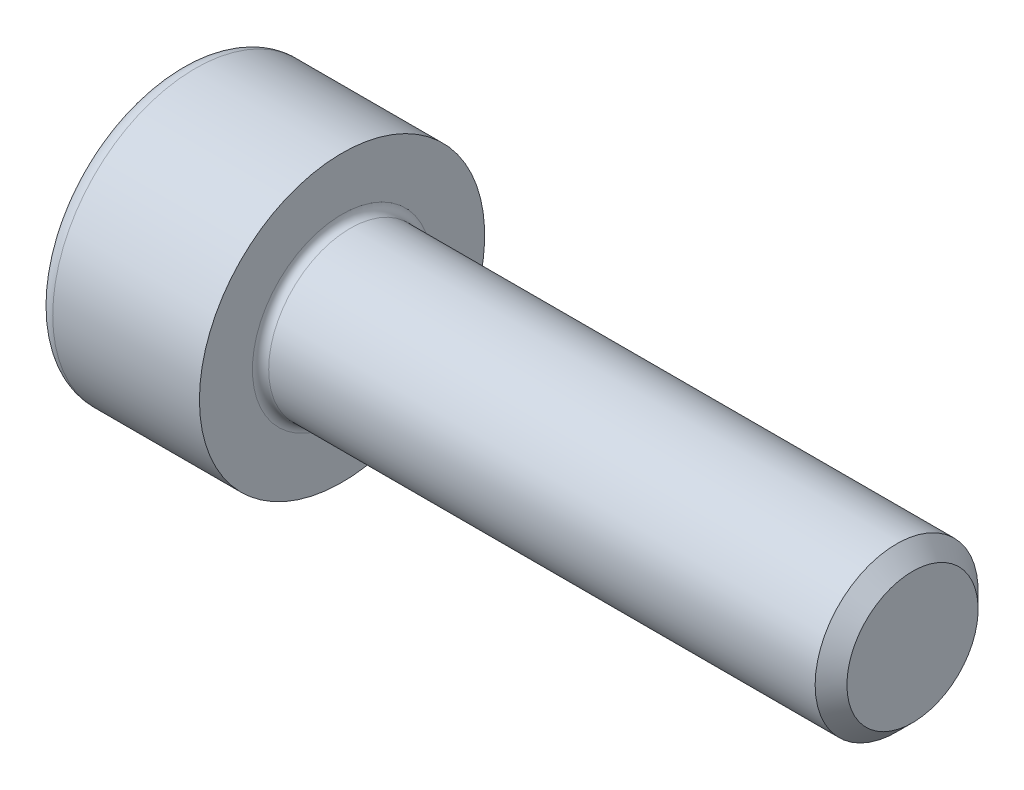
ISO-10303-21;
HEADER;
FILE_DESCRIPTION(('STEP AP214'),'2;1');
FILE_NAME('part.step','',(''),(''),'','','');
FILE_SCHEMA(('AUTOMOTIVE_DESIGN { 1 0 10303 214 1 1 1 1 }'));
ENDSEC;
DATA;
#1=APPLICATION_CONTEXT('core data for automotive mechanical design processes');
#2=APPLICATION_PROTOCOL_DEFINITION('international standard','automotive_design',2000,#1);
#3=PRODUCT_CONTEXT('',#1,'mechanical');
#4=PRODUCT('Part','Part','',(#3));
#5=PRODUCT_RELATED_PRODUCT_CATEGORY('part','',(#4));
#6=PRODUCT_DEFINITION_FORMATION('','',#4);
#7=PRODUCT_DEFINITION_CONTEXT('part definition',#1,'design');
#8=PRODUCT_DEFINITION('design','',#6,#7);
#9=PRODUCT_DEFINITION_SHAPE('','',#8);
#10=(LENGTH_UNIT() NAMED_UNIT(*) SI_UNIT(.MILLI.,.METRE.));
#11=(NAMED_UNIT(*) PLANE_ANGLE_UNIT() SI_UNIT($,.RADIAN.));
#12=(NAMED_UNIT(*) SI_UNIT($,.STERADIAN.) SOLID_ANGLE_UNIT());
#13=UNCERTAINTY_MEASURE_WITH_UNIT(LENGTH_MEASURE(1.E-05),#10,'distance_accuracy_value','');
#14=(GEOMETRIC_REPRESENTATION_CONTEXT(3) GLOBAL_UNCERTAINTY_ASSIGNED_CONTEXT((#13)) GLOBAL_UNIT_ASSIGNED_CONTEXT((#10,
#11,#12)) REPRESENTATION_CONTEXT('',''));
#15=CARTESIAN_POINT('',(0.,0.,0.));
#16=DIRECTION('',(0.,0.,1.));
#17=DIRECTION('',(1.,0.,0.));
#18=AXIS2_PLACEMENT_3D('',#15,#16,#17);
#19=CARTESIAN_POINT('',(0.,0.,0.));
#20=DIRECTION('',(-1.,0.,0.));
#21=DIRECTION('',(0.,0.,1.));
#22=AXIS2_PLACEMENT_3D('',#19,#20,#21);
#23=PLANE('',#22);
#24=DIRECTION('',(0.,-0.5,0.866025403784439));
#25=VECTOR('',#24,1.);
#26=CARTESIAN_POINT('',(0.,1.74359781295267,0.));
#27=LINE('',#26,#25);
#28=CARTESIAN_POINT('',(0.,1.74359781295267,0.));
#29=VERTEX_POINT('',#28);
#30=CARTESIAN_POINT('',(0.,0.87179890647633,1.51));
#31=VERTEX_POINT('',#30);
#32=EDGE_CURVE('E270',#29,#31,#27,.T.);
#33=ORIENTED_EDGE('',*,*,#32,.T.);
#34=DIRECTION('',(0.,1.,0.));
#35=VECTOR('',#34,1.);
#36=CARTESIAN_POINT('',(0.,-0.87179890647634,1.51));
#37=LINE('',#36,#35);
#38=CARTESIAN_POINT('',(0.,-0.87179890647634,1.51));
#39=VERTEX_POINT('',#38);
#40=EDGE_CURVE('E142',#39,#31,#37,.T.);
#41=ORIENTED_EDGE('',*,*,#40,.F.);
#42=DIRECTION('',(0.,-0.500000000000001,-0.866025403784438));
#43=VECTOR('',#42,1.);
#44=CARTESIAN_POINT('',(0.,-0.87179890647634,1.51));
#45=LINE('',#44,#43);
#46=CARTESIAN_POINT('',(0.,-1.74359781295268,0.));
#47=VERTEX_POINT('',#46);
#48=EDGE_CURVE('E273',#39,#47,#45,.T.);
#49=ORIENTED_EDGE('',*,*,#48,.T.);
#50=DIRECTION('',(0.,0.5,-0.866025403784439));
#51=VECTOR('',#50,1.);
#52=CARTESIAN_POINT('',(0.,-1.74359781295268,0.));
#53=LINE('',#52,#51);
#54=CARTESIAN_POINT('',(0.,-0.871798906476343,-1.51));
#55=VERTEX_POINT('',#54);
#56=EDGE_CURVE('E276',#47,#55,#53,.T.);
#57=ORIENTED_EDGE('',*,*,#56,.T.);
#58=DIRECTION('',(0.,-1.,0.));
#59=VECTOR('',#58,1.);
#60=CARTESIAN_POINT('',(0.,0.871798906476328,-1.51));
#61=LINE('',#60,#59);
#62=CARTESIAN_POINT('',(0.,0.871798906476328,-1.51));
#63=VERTEX_POINT('',#62);
#64=EDGE_CURVE('E279',#63,#55,#61,.T.);
#65=ORIENTED_EDGE('',*,*,#64,.F.);
#66=DIRECTION('',(0.,-0.500000000000001,-0.866025403784438));
#67=VECTOR('',#66,1.);
#68=CARTESIAN_POINT('',(0.,1.74359781295267,0.));
#69=LINE('',#68,#67);
#70=EDGE_CURVE('E137',#29,#63,#69,.T.);
#71=ORIENTED_EDGE('',*,*,#70,.F.);
#72=EDGE_LOOP('',(#33,#41,#49,#57,#65,#71));
#73=FACE_BOUND('',#72,.T.);
#74=CARTESIAN_POINT('',(0.,0.,0.));
#75=DIRECTION('',(-1.,0.,0.));
#76=DIRECTION('',(0.,0.,1.));
#77=AXIS2_PLACEMENT_3D('',#74,#75,#76);
#78=CIRCLE('',#77,3.1);
#79=CARTESIAN_POINT('',(0.,0.,3.1));
#80=VERTEX_POINT('',#79);
#81=EDGE_CURVE('E54',#80,#80,#78,.T.);
#82=ORIENTED_EDGE('',*,*,#81,.T.);
#83=EDGE_LOOP('',(#82));
#84=FACE_BOUND('',#83,.T.);
#85=ADVANCED_FACE('F46',(#73,#84),#23,.T.);
#86=CARTESIAN_POINT('',(-31.75,0.,0.));
#87=DIRECTION('',(-1.,0.,0.));
#88=DIRECTION('',(0.,0.,1.));
#89=AXIS2_PLACEMENT_3D('',#86,#87,#88);
#90=CYLINDRICAL_SURFACE('',#89,3.5);
#91=CARTESIAN_POINT('',(0.399999999999998,0.,0.));
#92=DIRECTION('',(-1.,0.,0.));
#93=DIRECTION('',(0.,0.,1.));
#94=AXIS2_PLACEMENT_3D('',#91,#92,#93);
#95=CIRCLE('',#94,3.5);
#96=CARTESIAN_POINT('',(0.399999999999998,0.,3.5));
#97=VERTEX_POINT('',#96);
#98=EDGE_CURVE('E13',#97,#97,#95,.F.);
#99=ORIENTED_EDGE('',*,*,#98,.T.);
#100=EDGE_LOOP('',(#99));
#101=FACE_BOUND('',#100,.T.);
#102=CARTESIAN_POINT('',(4.,0.,0.));
#103=DIRECTION('',(-1.,0.,0.));
#104=DIRECTION('',(0.,0.,1.));
#105=AXIS2_PLACEMENT_3D('',#102,#103,#104);
#106=CIRCLE('',#105,3.5);
#107=CARTESIAN_POINT('',(4.,0.,3.5));
#108=VERTEX_POINT('',#107);
#109=EDGE_CURVE('E160',#108,#108,#106,.T.);
#110=ORIENTED_EDGE('',*,*,#109,.T.);
#111=EDGE_LOOP('',(#110));
#112=FACE_BOUND('',#111,.T.);
#113=ADVANCED_FACE('F184',(#101,#112),#90,.T.);
#114=CARTESIAN_POINT('',(4.,3.5,0.));
#115=DIRECTION('',(1.,0.,0.));
#116=DIRECTION('',(0.,0.,-1.));
#117=AXIS2_PLACEMENT_3D('',#114,#115,#116);
#118=PLANE('',#117);
#119=CARTESIAN_POINT('',(4.,0.,0.));
#120=DIRECTION('',(1.,0.,0.));
#121=DIRECTION('',(0.,0.,-1.));
#122=AXIS2_PLACEMENT_3D('',#119,#120,#121);
#123=CIRCLE('',#122,2.2);
#124=CARTESIAN_POINT('',(4.,0.,-2.2));
#125=VERTEX_POINT('',#124);
#126=EDGE_CURVE('E163',#125,#125,#123,.F.);
#127=ORIENTED_EDGE('',*,*,#126,.T.);
#128=EDGE_LOOP('',(#127));
#129=FACE_BOUND('',#128,.T.);
#130=ORIENTED_EDGE('',*,*,#109,.F.);
#131=EDGE_LOOP('',(#130));
#132=FACE_BOUND('',#131,.T.);
#133=ADVANCED_FACE('F190',(#129,#132),#118,.T.);
#134=CARTESIAN_POINT('',(-31.75,0.,0.));
#135=DIRECTION('',(-1.,0.,0.));
#136=DIRECTION('',(0.,0.,1.));
#137=AXIS2_PLACEMENT_3D('',#134,#135,#136);
#138=CYLINDRICAL_SURFACE('',#137,2.);
#139=CARTESIAN_POINT('',(4.2,0.,0.));
#140=DIRECTION('',(1.,0.,0.));
#141=DIRECTION('',(0.,0.,-1.));
#142=AXIS2_PLACEMENT_3D('',#139,#140,#141);
#143=CIRCLE('',#142,2.);
#144=CARTESIAN_POINT('',(4.2,0.,-2.));
#145=VERTEX_POINT('',#144);
#146=EDGE_CURVE('E166',#145,#145,#143,.T.);
#147=ORIENTED_EDGE('',*,*,#146,.T.);
#148=EDGE_LOOP('',(#147));
#149=FACE_BOUND('',#148,.T.);
#150=CARTESIAN_POINT('',(17.61,0.,0.));
#151=DIRECTION('',(-1.,0.,0.));
#152=DIRECTION('',(0.,0.,1.));
#153=AXIS2_PLACEMENT_3D('',#150,#151,#152);
#154=CIRCLE('',#153,1.99999999999999);
#155=CARTESIAN_POINT('',(17.61,0.,1.99999999999999));
#156=VERTEX_POINT('',#155);
#157=EDGE_CURVE('E157',#156,#156,#154,.T.);
#158=ORIENTED_EDGE('',*,*,#157,.T.);
#159=EDGE_LOOP('',(#158));
#160=FACE_BOUND('',#159,.T.);
#161=ADVANCED_FACE('F196',(#149,#160),#138,.T.);
#162=CARTESIAN_POINT('',(18.,0.,0.));
#163=DIRECTION('',(-1.,0.,0.));
#164=DIRECTION('',(0.,0.,1.));
#165=AXIS2_PLACEMENT_3D('',#162,#163,#164);
#166=CONICAL_SURFACE('',#165,1.61,0.785398163397438);
#167=ORIENTED_EDGE('',*,*,#157,.F.);
#168=EDGE_LOOP('',(#167));
#169=FACE_BOUND('',#168,.T.);
#170=CARTESIAN_POINT('',(18.,0.,0.));
#171=DIRECTION('',(-1.,0.,0.));
#172=DIRECTION('',(0.,0.,1.));
#173=AXIS2_PLACEMENT_3D('',#170,#171,#172);
#174=CIRCLE('',#173,1.61);
#175=CARTESIAN_POINT('',(18.,0.,1.61));
#176=VERTEX_POINT('',#175);
#177=EDGE_CURVE('E153',#176,#176,#174,.T.);
#178=ORIENTED_EDGE('',*,*,#177,.T.);
#179=EDGE_LOOP('',(#178));
#180=FACE_BOUND('',#179,.T.);
#181=ADVANCED_FACE('F200',(#169,#180),#166,.T.);
#182=CARTESIAN_POINT('',(18.,1.61,0.));
#183=DIRECTION('',(1.,0.,0.));
#184=DIRECTION('',(0.,0.,-1.));
#185=AXIS2_PLACEMENT_3D('',#182,#183,#184);
#186=PLANE('',#185);
#187=ORIENTED_EDGE('',*,*,#177,.F.);
#188=EDGE_LOOP('',(#187));
#189=FACE_BOUND('',#188,.T.);
#190=ADVANCED_FACE('F180',(#189),#186,.T.);
#191=CARTESIAN_POINT('',(4.2,0.,0.));
#192=DIRECTION('',(1.,0.,0.));
#193=DIRECTION('',(0.,0.,-1.));
#194=AXIS2_PLACEMENT_3D('',#191,#192,#193);
#195=TOROIDAL_SURFACE('',#194,2.2,0.2);
#196=ORIENTED_EDGE('',*,*,#146,.F.);
#197=EDGE_LOOP('',(#196));
#198=FACE_BOUND('',#197,.T.);
#199=ORIENTED_EDGE('',*,*,#126,.F.);
#200=EDGE_LOOP('',(#199));
#201=FACE_BOUND('',#200,.T.);
#202=ADVANCED_FACE('F173',(#198,#201),#195,.F.);
#203=CARTESIAN_POINT('',(0.399999999999998,0.,0.));
#204=DIRECTION('',(-1.,0.,0.));
#205=DIRECTION('',(0.,0.,1.));
#206=AXIS2_PLACEMENT_3D('',#203,#204,#205);
#207=TOROIDAL_SURFACE('',#206,3.1,0.4);
#208=ORIENTED_EDGE('',*,*,#98,.F.);
#209=EDGE_LOOP('',(#208));
#210=FACE_BOUND('',#209,.T.);
#211=ORIENTED_EDGE('',*,*,#81,.F.);
#212=EDGE_LOOP('',(#211));
#213=FACE_BOUND('',#212,.T.);
#214=ADVANCED_FACE('F48',(#210,#213),#207,.T.);
#215=CARTESIAN_POINT('',(2.,1.74359781295267,0.));
#216=DIRECTION('',(0.,-0.866025403784439,-0.5));
#217=DIRECTION('',(0.,0.5,-0.866025403784439));
#218=AXIS2_PLACEMENT_3D('',#215,#216,#217);
#219=PLANE('',#218);
#220=ORIENTED_EDGE('',*,*,#32,.F.);
#221=DIRECTION('',(-1.,0.,0.));
#222=VECTOR('',#221,1.);
#223=CARTESIAN_POINT('',(2.,1.74359781295267,0.));
#224=LINE('',#223,#222);
#225=CARTESIAN_POINT('',(2.,1.74359781295267,0.));
#226=VERTEX_POINT('',#225);
#227=EDGE_CURVE('E260',#226,#29,#224,.T.);
#228=ORIENTED_EDGE('',*,*,#227,.F.);
#229=DIRECTION('',(0.,-0.5,0.866025403784439));
#230=VECTOR('',#229,1.);
#231=CARTESIAN_POINT('',(2.,1.74359781295267,0.));
#232=LINE('',#231,#230);
#233=CARTESIAN_POINT('',(2.,1.3076983597145,0.754999999999997));
#234=VERTEX_POINT('',#233);
#235=EDGE_CURVE('E129',#226,#234,#232,.T.);
#236=ORIENTED_EDGE('',*,*,#235,.T.);
#237=CARTESIAN_POINT('',(2.,0.87179890647633,1.51));
#238=VERTEX_POINT('',#237);
#239=EDGE_CURVE('E120',#234,#238,#232,.T.);
#240=ORIENTED_EDGE('',*,*,#239,.T.);
#241=DIRECTION('',(-1.,0.,0.));
#242=VECTOR('',#241,1.);
#243=CARTESIAN_POINT('',(2.,0.87179890647633,1.51));
#244=LINE('',#243,#242);
#245=EDGE_CURVE('E134',#238,#31,#244,.T.);
#246=ORIENTED_EDGE('',*,*,#245,.T.);
#247=EDGE_LOOP('',(#220,#228,#236,#240,#246));
#248=FACE_BOUND('',#247,.T.);
#249=ADVANCED_FACE('F133',(#248),#219,.T.);
#250=CARTESIAN_POINT('',(2.,-0.87179890647634,1.51));
#251=DIRECTION('',(0.,0.,1.));
#252=DIRECTION('',(0.,-1.,0.));
#253=AXIS2_PLACEMENT_3D('',#250,#251,#252);
#254=PLANE('',#253);
#255=ORIENTED_EDGE('',*,*,#40,.T.);
#256=ORIENTED_EDGE('',*,*,#245,.F.);
#257=DIRECTION('',(0.,1.,0.));
#258=VECTOR('',#257,1.);
#259=CARTESIAN_POINT('',(2.,-0.87179890647634,1.51));
#260=LINE('',#259,#258);
#261=CARTESIAN_POINT('',(2.,0.,1.51));
#262=VERTEX_POINT('',#261);
#263=EDGE_CURVE('E117',#262,#238,#260,.T.);
#264=ORIENTED_EDGE('',*,*,#263,.F.);
#265=CARTESIAN_POINT('',(2.,-0.87179890647634,1.51));
#266=VERTEX_POINT('',#265);
#267=EDGE_CURVE('E128',#266,#262,#260,.T.);
#268=ORIENTED_EDGE('',*,*,#267,.F.);
#269=DIRECTION('',(-1.,0.,0.));
#270=VECTOR('',#269,1.);
#271=CARTESIAN_POINT('',(2.,-0.87179890647634,1.51));
#272=LINE('',#271,#270);
#273=EDGE_CURVE('E144',#266,#39,#272,.T.);
#274=ORIENTED_EDGE('',*,*,#273,.T.);
#275=EDGE_LOOP('',(#255,#256,#264,#268,#274));
#276=FACE_BOUND('',#275,.T.);
#277=ADVANCED_FACE('F139',(#276),#254,.F.);
#278=CARTESIAN_POINT('',(2.,-0.87179890647634,1.51));
#279=DIRECTION('',(0.,0.866025403784438,-0.500000000000001));
#280=DIRECTION('',(0.,0.500000000000001,0.866025403784438));
#281=AXIS2_PLACEMENT_3D('',#278,#279,#280);
#282=PLANE('',#281);
#283=ORIENTED_EDGE('',*,*,#48,.F.);
#284=ORIENTED_EDGE('',*,*,#273,.F.);
#285=DIRECTION('',(0.,-0.500000000000001,-0.866025403784438));
#286=VECTOR('',#285,1.);
#287=CARTESIAN_POINT('',(2.,-0.87179890647634,1.51));
#288=LINE('',#287,#286);
#289=CARTESIAN_POINT('',(2.,-1.30769835971451,0.755000000000004));
#290=VERTEX_POINT('',#289);
#291=EDGE_CURVE('E299',#266,#290,#288,.T.);
#292=ORIENTED_EDGE('',*,*,#291,.T.);
#293=CARTESIAN_POINT('',(2.,-1.74359781295268,0.));
#294=VERTEX_POINT('',#293);
#295=EDGE_CURVE('E288',#290,#294,#288,.T.);
#296=ORIENTED_EDGE('',*,*,#295,.T.);
#297=DIRECTION('',(-1.,0.,0.));
#298=VECTOR('',#297,1.);
#299=CARTESIAN_POINT('',(2.,-1.74359781295268,0.));
#300=LINE('',#299,#298);
#301=EDGE_CURVE('E149',#294,#47,#300,.T.);
#302=ORIENTED_EDGE('',*,*,#301,.T.);
#303=EDGE_LOOP('',(#283,#284,#292,#296,#302));
#304=FACE_BOUND('',#303,.T.);
#305=ADVANCED_FACE('F214',(#304),#282,.T.);
#306=CARTESIAN_POINT('',(2.,-1.74359781295268,0.));
#307=DIRECTION('',(0.,0.866025403784439,0.5));
#308=DIRECTION('',(0.,-0.5,0.866025403784439));
#309=AXIS2_PLACEMENT_3D('',#306,#307,#308);
#310=PLANE('',#309);
#311=ORIENTED_EDGE('',*,*,#56,.F.);
#312=ORIENTED_EDGE('',*,*,#301,.F.);
#313=DIRECTION('',(0.,0.5,-0.866025403784439));
#314=VECTOR('',#313,1.);
#315=CARTESIAN_POINT('',(2.,-1.74359781295268,0.));
#316=LINE('',#315,#314);
#317=CARTESIAN_POINT('',(2.,-1.30769835971451,-0.755000000000002));
#318=VERTEX_POINT('',#317);
#319=EDGE_CURVE('E266',#294,#318,#316,.T.);
#320=ORIENTED_EDGE('',*,*,#319,.T.);
#321=CARTESIAN_POINT('',(2.,-0.871798906476343,-1.51));
#322=VERTEX_POINT('',#321);
#323=EDGE_CURVE('E298',#318,#322,#316,.T.);
#324=ORIENTED_EDGE('',*,*,#323,.T.);
#325=DIRECTION('',(-1.,0.,0.));
#326=VECTOR('',#325,1.);
#327=CARTESIAN_POINT('',(2.,-0.871798906476343,-1.51));
#328=LINE('',#327,#326);
#329=EDGE_CURVE('E259',#322,#55,#328,.T.);
#330=ORIENTED_EDGE('',*,*,#329,.T.);
#331=EDGE_LOOP('',(#311,#312,#320,#324,#330));
#332=FACE_BOUND('',#331,.T.);
#333=ADVANCED_FACE('F217',(#332),#310,.T.);
#334=CARTESIAN_POINT('',(2.,0.871798906476328,-1.51));
#335=DIRECTION('',(0.,0.,-1.));
#336=DIRECTION('',(0.,1.,0.));
#337=AXIS2_PLACEMENT_3D('',#334,#335,#336);
#338=PLANE('',#337);
#339=ORIENTED_EDGE('',*,*,#64,.T.);
#340=ORIENTED_EDGE('',*,*,#329,.F.);
#341=DIRECTION('',(0.,-1.,0.));
#342=VECTOR('',#341,1.);
#343=CARTESIAN_POINT('',(2.,0.871798906476328,-1.51));
#344=LINE('',#343,#342);
#345=CARTESIAN_POINT('',(2.,0.,-1.51));
#346=VERTEX_POINT('',#345);
#347=EDGE_CURVE('E263',#346,#322,#344,.T.);
#348=ORIENTED_EDGE('',*,*,#347,.F.);
#349=CARTESIAN_POINT('',(2.,0.871798906476328,-1.51));
#350=VERTEX_POINT('',#349);
#351=EDGE_CURVE('E61',#350,#346,#344,.T.);
#352=ORIENTED_EDGE('',*,*,#351,.F.);
#353=DIRECTION('',(-1.,0.,0.));
#354=VECTOR('',#353,1.);
#355=CARTESIAN_POINT('',(2.,0.871798906476328,-1.51));
#356=LINE('',#355,#354);
#357=EDGE_CURVE('E256',#350,#63,#356,.T.);
#358=ORIENTED_EDGE('',*,*,#357,.T.);
#359=EDGE_LOOP('',(#339,#340,#348,#352,#358));
#360=FACE_BOUND('',#359,.T.);
#361=ADVANCED_FACE('F221',(#360),#338,.F.);
#362=CARTESIAN_POINT('',(2.,1.74359781295267,0.));
#363=DIRECTION('',(0.,0.866025403784438,-0.500000000000001));
#364=DIRECTION('',(0.,0.500000000000001,0.866025403784438));
#365=AXIS2_PLACEMENT_3D('',#362,#363,#364);
#366=PLANE('',#365);
#367=ORIENTED_EDGE('',*,*,#70,.T.);
#368=ORIENTED_EDGE('',*,*,#357,.F.);
#369=DIRECTION('',(0.,-0.500000000000001,-0.866025403784438));
#370=VECTOR('',#369,1.);
#371=CARTESIAN_POINT('',(2.,1.74359781295267,0.));
#372=LINE('',#371,#370);
#373=CARTESIAN_POINT('',(2.,1.3076983597145,-0.755));
#374=VERTEX_POINT('',#373);
#375=EDGE_CURVE('E246',#374,#350,#372,.T.);
#376=ORIENTED_EDGE('',*,*,#375,.F.);
#377=EDGE_CURVE('E252',#226,#374,#372,.T.);
#378=ORIENTED_EDGE('',*,*,#377,.F.);
#379=ORIENTED_EDGE('',*,*,#227,.T.);
#380=EDGE_LOOP('',(#367,#368,#376,#378,#379));
#381=FACE_BOUND('',#380,.T.);
#382=ADVANCED_FACE('F225',(#381),#366,.F.);
#383=CARTESIAN_POINT('',(2.,1.74359781295267,0.));
#384=DIRECTION('',(1.,0.,0.));
#385=DIRECTION('',(0.,0.,-1.));
#386=AXIS2_PLACEMENT_3D('',#383,#384,#385);
#387=PLANE('',#386);
#388=ORIENTED_EDGE('',*,*,#347,.T.);
#389=ORIENTED_EDGE('',*,*,#323,.F.);
#390=CARTESIAN_POINT('',(2.,0.,0.));
#391=DIRECTION('',(-1.,0.,0.));
#392=DIRECTION('',(0.,0.,1.));
#393=AXIS2_PLACEMENT_3D('',#390,#391,#392);
#394=CIRCLE('',#393,1.51);
#395=EDGE_CURVE('E294',#346,#318,#394,.T.);
#396=ORIENTED_EDGE('',*,*,#395,.F.);
#397=EDGE_LOOP('',(#388,#389,#396));
#398=FACE_BOUND('',#397,.T.);
#399=ADVANCED_FACE('F229',(#398),#387,.F.);
#400=ORIENTED_EDGE('',*,*,#319,.F.);
#401=ORIENTED_EDGE('',*,*,#295,.F.);
#402=EDGE_CURVE('E147',#318,#290,#394,.T.);
#403=ORIENTED_EDGE('',*,*,#402,.F.);
#404=EDGE_LOOP('',(#400,#401,#403));
#405=FACE_BOUND('',#404,.T.);
#406=ADVANCED_FACE('F232',(#405),#387,.F.);
#407=ORIENTED_EDGE('',*,*,#291,.F.);
#408=ORIENTED_EDGE('',*,*,#267,.T.);
#409=EDGE_CURVE('E143',#290,#262,#394,.T.);
#410=ORIENTED_EDGE('',*,*,#409,.F.);
#411=EDGE_LOOP('',(#407,#408,#410));
#412=FACE_BOUND('',#411,.T.);
#413=ADVANCED_FACE('F237',(#412),#387,.F.);
#414=ORIENTED_EDGE('',*,*,#263,.T.);
#415=ORIENTED_EDGE('',*,*,#239,.F.);
#416=EDGE_CURVE('E123',#262,#234,#394,.T.);
#417=ORIENTED_EDGE('',*,*,#416,.F.);
#418=EDGE_LOOP('',(#414,#415,#417));
#419=FACE_BOUND('',#418,.T.);
#420=ADVANCED_FACE('F119',(#419),#387,.F.);
#421=ORIENTED_EDGE('',*,*,#235,.F.);
#422=ORIENTED_EDGE('',*,*,#377,.T.);
#423=EDGE_CURVE('E154',#234,#374,#394,.T.);
#424=ORIENTED_EDGE('',*,*,#423,.F.);
#425=EDGE_LOOP('',(#421,#422,#424));
#426=FACE_BOUND('',#425,.T.);
#427=ADVANCED_FACE('F240',(#426),#387,.F.);
#428=ORIENTED_EDGE('',*,*,#375,.T.);
#429=ORIENTED_EDGE('',*,*,#351,.T.);
#430=EDGE_CURVE('E249',#374,#346,#394,.T.);
#431=ORIENTED_EDGE('',*,*,#430,.F.);
#432=EDGE_LOOP('',(#428,#429,#431));
#433=FACE_BOUND('',#432,.T.);
#434=ADVANCED_FACE('F210',(#433),#387,.F.);
#435=CARTESIAN_POINT('',(2.,0.,0.));
#436=DIRECTION('',(-1.,0.,0.));
#437=DIRECTION('',(0.,0.,1.));
#438=AXIS2_PLACEMENT_3D('',#435,#436,#437);
#439=CONICAL_SURFACE('',#438,1.51,1.04719755119659);
#440=CARTESIAN_POINT('',(2.87179890647635,0.,0.));
#441=VERTEX_POINT('',#440);
#442=VERTEX_LOOP('',#441);
#443=FACE_BOUND('',#442,.T.);
#444=ORIENTED_EDGE('',*,*,#416,.T.);
#445=ORIENTED_EDGE('',*,*,#423,.T.);
#446=ORIENTED_EDGE('',*,*,#430,.T.);
#447=ORIENTED_EDGE('',*,*,#395,.T.);
#448=ORIENTED_EDGE('',*,*,#402,.T.);
#449=ORIENTED_EDGE('',*,*,#409,.T.);
#450=EDGE_LOOP('',(#444,#445,#446,#447,#448,#449));
#451=FACE_BOUND('',#450,.T.);
#452=ADVANCED_FACE('F208',(#443,#451),#439,.F.);
#453=CLOSED_SHELL('',(#85,#113,#133,#161,#181,#190,#202,#214,#249,#277,#305,#333,#361,#382,#399,
#406,#413,#420,#427,#434,#452));
#454=MANIFOLD_SOLID_BREP('B2',#453);
#455=ADVANCED_BREP_SHAPE_REPRESENTATION('',(#18,#454),#14);
#456=SHAPE_DEFINITION_REPRESENTATION(#9,#455);
ENDSEC;
END-ISO-10303-21;
